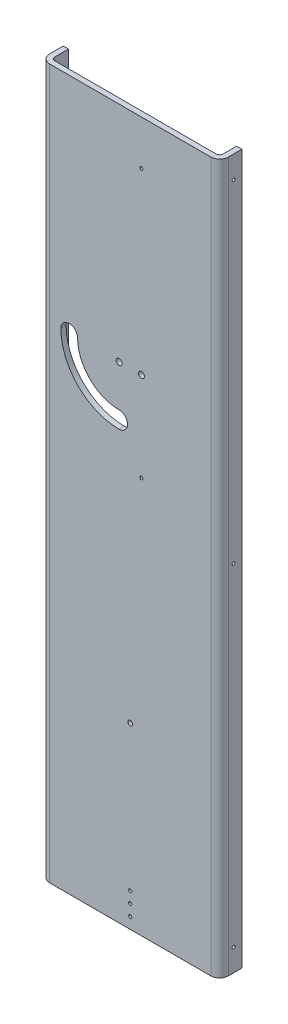
ISO-10303-21;
HEADER;
FILE_DESCRIPTION(('STEP AP214'),'2;1');
FILE_NAME('part.step','',(''),(''),'','','');
FILE_SCHEMA(('AUTOMOTIVE_DESIGN { 1 0 10303 214 1 1 1 1 }'));
ENDSEC;
DATA;
#1=APPLICATION_CONTEXT('core data for automotive mechanical design processes');
#2=APPLICATION_PROTOCOL_DEFINITION('international standard','automotive_design',2000,#1);
#3=PRODUCT_CONTEXT('',#1,'mechanical');
#4=PRODUCT('Part','Part','',(#3));
#5=PRODUCT_RELATED_PRODUCT_CATEGORY('part','',(#4));
#6=PRODUCT_DEFINITION_FORMATION('','',#4);
#7=PRODUCT_DEFINITION_CONTEXT('part definition',#1,'design');
#8=PRODUCT_DEFINITION('design','',#6,#7);
#9=PRODUCT_DEFINITION_SHAPE('','',#8);
#10=(LENGTH_UNIT() NAMED_UNIT(*) SI_UNIT(.MILLI.,.METRE.));
#11=(NAMED_UNIT(*) PLANE_ANGLE_UNIT() SI_UNIT($,.RADIAN.));
#12=(NAMED_UNIT(*) SI_UNIT($,.STERADIAN.) SOLID_ANGLE_UNIT());
#13=UNCERTAINTY_MEASURE_WITH_UNIT(LENGTH_MEASURE(1.E-05),#10,'distance_accuracy_value','');
#14=(GEOMETRIC_REPRESENTATION_CONTEXT(3) GLOBAL_UNCERTAINTY_ASSIGNED_CONTEXT((#13)) GLOBAL_UNIT_ASSIGNED_CONTEXT((#10,
#11,#12)) REPRESENTATION_CONTEXT('',''));
#15=CARTESIAN_POINT('',(0.,0.,0.));
#16=DIRECTION('',(0.,0.,1.));
#17=DIRECTION('',(1.,0.,0.));
#18=AXIS2_PLACEMENT_3D('',#15,#16,#17);
#19=CARTESIAN_POINT('',(101.6,584.2,-9.875));
#20=DIRECTION('',(-1.,0.,0.));
#21=DIRECTION('',(0.,0.,1.));
#22=AXIS2_PLACEMENT_3D('',#19,#20,#21);
#23=CYLINDRICAL_SURFACE('',#22,1.62941);
#24=CARTESIAN_POINT('',(101.6,584.2,-9.875));
#25=DIRECTION('',(-1.,0.,0.));
#26=DIRECTION('',(0.,0.,1.));
#27=AXIS2_PLACEMENT_3D('',#24,#25,#26);
#28=CIRCLE('',#27,1.62941);
#29=CARTESIAN_POINT('',(101.6,584.2,-8.24559));
#30=VERTEX_POINT('',#29);
#31=EDGE_CURVE('E21',#30,#30,#28,.F.);
#32=ORIENTED_EDGE('',*,*,#31,.T.);
#33=EDGE_LOOP('',(#32));
#34=FACE_BOUND('',#33,.T.);
#35=CARTESIAN_POINT('',(95.6,584.2,-9.875));
#36=DIRECTION('',(-1.,0.,0.));
#37=DIRECTION('',(0.,0.,1.));
#38=AXIS2_PLACEMENT_3D('',#35,#36,#37);
#39=CIRCLE('',#38,1.62941);
#40=CARTESIAN_POINT('',(95.6,584.2,-8.24559));
#41=VERTEX_POINT('',#40);
#42=EDGE_CURVE('E295',#41,#41,#39,.F.);
#43=ORIENTED_EDGE('',*,*,#42,.F.);
#44=EDGE_LOOP('',(#43));
#45=FACE_BOUND('',#44,.T.);
#46=ADVANCED_FACE('F17',(#34,#45),#23,.F.);
#47=CARTESIAN_POINT('',(101.6,206.375,-9.875));
#48=DIRECTION('',(-1.,0.,0.));
#49=DIRECTION('',(0.,0.,1.));
#50=AXIS2_PLACEMENT_3D('',#47,#48,#49);
#51=CYLINDRICAL_SURFACE('',#50,1.62941);
#52=CARTESIAN_POINT('',(101.6,206.375,-9.875));
#53=DIRECTION('',(-1.,0.,0.));
#54=DIRECTION('',(0.,0.,1.));
#55=AXIS2_PLACEMENT_3D('',#52,#53,#54);
#56=CIRCLE('',#55,1.62941);
#57=CARTESIAN_POINT('',(101.6,206.375,-8.24559));
#58=VERTEX_POINT('',#57);
#59=EDGE_CURVE('E299',#58,#58,#56,.F.);
#60=ORIENTED_EDGE('',*,*,#59,.T.);
#61=EDGE_LOOP('',(#60));
#62=FACE_BOUND('',#61,.T.);
#63=CARTESIAN_POINT('',(95.6,206.375,-9.875));
#64=DIRECTION('',(-1.,0.,0.));
#65=DIRECTION('',(0.,0.,1.));
#66=AXIS2_PLACEMENT_3D('',#63,#64,#65);
#67=CIRCLE('',#66,1.62941);
#68=CARTESIAN_POINT('',(95.6,206.375,-8.24559));
#69=VERTEX_POINT('',#68);
#70=EDGE_CURVE('E292',#69,#69,#67,.F.);
#71=ORIENTED_EDGE('',*,*,#70,.F.);
#72=EDGE_LOOP('',(#71));
#73=FACE_BOUND('',#72,.T.);
#74=ADVANCED_FACE('F403',(#62,#73),#51,.F.);
#75=CARTESIAN_POINT('',(101.6,-171.45,-9.875));
#76=DIRECTION('',(-1.,0.,0.));
#77=DIRECTION('',(0.,0.,1.));
#78=AXIS2_PLACEMENT_3D('',#75,#76,#77);
#79=CYLINDRICAL_SURFACE('',#78,1.62941);
#80=CARTESIAN_POINT('',(101.6,-171.45,-9.875));
#81=DIRECTION('',(-1.,0.,0.));
#82=DIRECTION('',(0.,0.,1.));
#83=AXIS2_PLACEMENT_3D('',#80,#81,#82);
#84=CIRCLE('',#83,1.62941);
#85=CARTESIAN_POINT('',(101.6,-171.45,-8.24559));
#86=VERTEX_POINT('',#85);
#87=EDGE_CURVE('E150',#86,#86,#84,.F.);
#88=ORIENTED_EDGE('',*,*,#87,.T.);
#89=EDGE_LOOP('',(#88));
#90=FACE_BOUND('',#89,.T.);
#91=CARTESIAN_POINT('',(95.6,-171.45,-9.875));
#92=DIRECTION('',(-1.,0.,0.));
#93=DIRECTION('',(0.,0.,1.));
#94=AXIS2_PLACEMENT_3D('',#91,#92,#93);
#95=CIRCLE('',#94,1.62941);
#96=CARTESIAN_POINT('',(95.6,-171.45,-8.24559));
#97=VERTEX_POINT('',#96);
#98=EDGE_CURVE('E289',#97,#97,#95,.F.);
#99=ORIENTED_EDGE('',*,*,#98,.F.);
#100=EDGE_LOOP('',(#99));
#101=FACE_BOUND('',#100,.T.);
#102=ADVANCED_FACE('F399',(#90,#101),#79,.F.);
#103=CARTESIAN_POINT('',(-95.6,584.2,-9.875));
#104=DIRECTION('',(-1.,0.,0.));
#105=DIRECTION('',(0.,0.,1.));
#106=AXIS2_PLACEMENT_3D('',#103,#104,#105);
#107=CYLINDRICAL_SURFACE('',#106,1.62941);
#108=CARTESIAN_POINT('',(-95.6,584.2,-9.875));
#109=DIRECTION('',(-1.,0.,0.));
#110=DIRECTION('',(0.,0.,1.));
#111=AXIS2_PLACEMENT_3D('',#108,#109,#110);
#112=CIRCLE('',#111,1.62941);
#113=CARTESIAN_POINT('',(-95.6,584.2,-8.24559));
#114=VERTEX_POINT('',#113);
#115=EDGE_CURVE('E286',#114,#114,#112,.T.);
#116=ORIENTED_EDGE('',*,*,#115,.F.);
#117=EDGE_LOOP('',(#116));
#118=FACE_BOUND('',#117,.T.);
#119=CARTESIAN_POINT('',(-101.6,584.2,-9.875));
#120=DIRECTION('',(-1.,0.,0.));
#121=DIRECTION('',(0.,0.,1.));
#122=AXIS2_PLACEMENT_3D('',#119,#120,#121);
#123=CIRCLE('',#122,1.62941);
#124=CARTESIAN_POINT('',(-101.6,584.2,-8.24559));
#125=VERTEX_POINT('',#124);
#126=EDGE_CURVE('E275',#125,#125,#123,.T.);
#127=ORIENTED_EDGE('',*,*,#126,.T.);
#128=EDGE_LOOP('',(#127));
#129=FACE_BOUND('',#128,.T.);
#130=ADVANCED_FACE('F395',(#118,#129),#107,.F.);
#131=CARTESIAN_POINT('',(-95.6,206.375,-9.875));
#132=DIRECTION('',(-1.,0.,0.));
#133=DIRECTION('',(0.,0.,1.));
#134=AXIS2_PLACEMENT_3D('',#131,#132,#133);
#135=CYLINDRICAL_SURFACE('',#134,1.62941);
#136=CARTESIAN_POINT('',(-95.6,206.375,-9.875));
#137=DIRECTION('',(-1.,0.,0.));
#138=DIRECTION('',(0.,0.,1.));
#139=AXIS2_PLACEMENT_3D('',#136,#137,#138);
#140=CIRCLE('',#139,1.62941);
#141=CARTESIAN_POINT('',(-95.6,206.375,-8.24559));
#142=VERTEX_POINT('',#141);
#143=EDGE_CURVE('E283',#142,#142,#140,.T.);
#144=ORIENTED_EDGE('',*,*,#143,.F.);
#145=EDGE_LOOP('',(#144));
#146=FACE_BOUND('',#145,.T.);
#147=CARTESIAN_POINT('',(-101.6,206.375,-9.875));
#148=DIRECTION('',(-1.,0.,0.));
#149=DIRECTION('',(0.,0.,1.));
#150=AXIS2_PLACEMENT_3D('',#147,#148,#149);
#151=CIRCLE('',#150,1.62941);
#152=CARTESIAN_POINT('',(-101.6,206.375,-8.24559));
#153=VERTEX_POINT('',#152);
#154=EDGE_CURVE('E272',#153,#153,#151,.T.);
#155=ORIENTED_EDGE('',*,*,#154,.T.);
#156=EDGE_LOOP('',(#155));
#157=FACE_BOUND('',#156,.T.);
#158=ADVANCED_FACE('F319',(#146,#157),#135,.F.);
#159=CARTESIAN_POINT('',(-95.6,-171.45,-9.875));
#160=DIRECTION('',(-1.,0.,0.));
#161=DIRECTION('',(0.,0.,1.));
#162=AXIS2_PLACEMENT_3D('',#159,#160,#161);
#163=CYLINDRICAL_SURFACE('',#162,1.62941);
#164=CARTESIAN_POINT('',(-95.6,-171.45,-9.875));
#165=DIRECTION('',(-1.,0.,0.));
#166=DIRECTION('',(0.,0.,1.));
#167=AXIS2_PLACEMENT_3D('',#164,#165,#166);
#168=CIRCLE('',#167,1.62941);
#169=CARTESIAN_POINT('',(-95.6,-171.45,-8.24559));
#170=VERTEX_POINT('',#169);
#171=EDGE_CURVE('E279',#170,#170,#168,.T.);
#172=ORIENTED_EDGE('',*,*,#171,.F.);
#173=EDGE_LOOP('',(#172));
#174=FACE_BOUND('',#173,.T.);
#175=CARTESIAN_POINT('',(-101.6,-171.45,-9.875));
#176=DIRECTION('',(-1.,0.,0.));
#177=DIRECTION('',(0.,0.,1.));
#178=AXIS2_PLACEMENT_3D('',#175,#176,#177);
#179=CIRCLE('',#178,1.62941);
#180=CARTESIAN_POINT('',(-101.6,-171.45,-8.24559));
#181=VERTEX_POINT('',#180);
#182=EDGE_CURVE('E269',#181,#181,#179,.T.);
#183=ORIENTED_EDGE('',*,*,#182,.T.);
#184=EDGE_LOOP('',(#183));
#185=FACE_BOUND('',#184,.T.);
#186=ADVANCED_FACE('F309',(#174,#185),#163,.F.);
#187=CARTESIAN_POINT('',(101.6,-196.85,-19.4));
#188=DIRECTION('',(-1.,0.,0.));
#189=DIRECTION('',(0.,0.,1.));
#190=AXIS2_PLACEMENT_3D('',#187,#188,#189);
#191=PLANE('',#190);
#192=ORIENTED_EDGE('',*,*,#87,.F.);
#193=EDGE_LOOP('',(#192));
#194=FACE_BOUND('',#193,.T.);
#195=ORIENTED_EDGE('',*,*,#59,.F.);
#196=EDGE_LOOP('',(#195));
#197=FACE_BOUND('',#196,.T.);
#198=ORIENTED_EDGE('',*,*,#31,.F.);
#199=EDGE_LOOP('',(#198));
#200=FACE_BOUND('',#199,.T.);
#201=DIRECTION('',(0.,0.,-1.));
#202=VECTOR('',#201,1.);
#203=CARTESIAN_POINT('',(101.6,609.6,-6.7));
#204=LINE('',#203,#202);
#205=CARTESIAN_POINT('',(101.6,609.6,-4.00000012697449));
#206=VERTEX_POINT('',#205);
#207=CARTESIAN_POINT('',(101.6,609.6,-19.4));
#208=VERTEX_POINT('',#207);
#209=EDGE_CURVE('E132',#206,#208,#204,.T.);
#210=ORIENTED_EDGE('',*,*,#209,.F.);
#211=DIRECTION('',(0.,1.,0.));
#212=VECTOR('',#211,1.);
#213=CARTESIAN_POINT('',(101.6,206.375,-4.00000012594898));
#214=LINE('',#213,#212);
#215=CARTESIAN_POINT('',(101.6,-196.85,-4.00000012697449));
#216=VERTEX_POINT('',#215);
#217=EDGE_CURVE('E165',#206,#216,#214,.F.);
#218=ORIENTED_EDGE('',*,*,#217,.T.);
#219=DIRECTION('',(0.,0.,-1.));
#220=VECTOR('',#219,1.);
#221=CARTESIAN_POINT('',(101.6,-196.85,-6.7));
#222=LINE('',#221,#220);
#223=CARTESIAN_POINT('',(101.6,-196.85,-19.4));
#224=VERTEX_POINT('',#223);
#225=EDGE_CURVE('E146',#216,#224,#222,.T.);
#226=ORIENTED_EDGE('',*,*,#225,.T.);
#227=DIRECTION('',(0.,1.,0.));
#228=VECTOR('',#227,1.);
#229=CARTESIAN_POINT('',(101.6,206.375,-19.4));
#230=LINE('',#229,#228);
#231=EDGE_CURVE('E144',#224,#208,#230,.T.);
#232=ORIENTED_EDGE('',*,*,#231,.T.);
#233=EDGE_LOOP('',(#210,#218,#226,#232));
#234=FACE_BOUND('',#233,.T.);
#235=ADVANCED_FACE('F145',(#194,#197,#200,#234),#191,.F.);
#236=CARTESIAN_POINT('',(95.6,-196.85,-19.4));
#237=DIRECTION('',(0.,0.,1.));
#238=DIRECTION('',(1.,0.,0.));
#239=AXIS2_PLACEMENT_3D('',#236,#237,#238);
#240=PLANE('',#239);
#241=DIRECTION('',(-1.,0.,0.));
#242=VECTOR('',#241,1.);
#243=CARTESIAN_POINT('',(0.,-196.85,-19.4));
#244=LINE('',#243,#242);
#245=CARTESIAN_POINT('',(95.6000000056,-196.85,-19.4));
#246=VERTEX_POINT('',#245);
#247=EDGE_CURVE('E176',#224,#246,#244,.T.);
#248=ORIENTED_EDGE('',*,*,#247,.T.);
#249=DIRECTION('',(0.,-1.,0.));
#250=VECTOR('',#249,1.);
#251=CARTESIAN_POINT('',(95.6,206.375,-19.4));
#252=LINE('',#251,#250);
#253=CARTESIAN_POINT('',(95.6000000074666,609.6,-19.4));
#254=VERTEX_POINT('',#253);
#255=EDGE_CURVE('E120',#254,#246,#252,.T.);
#256=ORIENTED_EDGE('',*,*,#255,.F.);
#257=DIRECTION('',(-1.,0.,0.));
#258=VECTOR('',#257,1.);
#259=CARTESIAN_POINT('',(0.,609.6,-19.4));
#260=LINE('',#259,#258);
#261=EDGE_CURVE('E136',#208,#254,#260,.T.);
#262=ORIENTED_EDGE('',*,*,#261,.F.);
#263=ORIENTED_EDGE('',*,*,#231,.F.);
#264=EDGE_LOOP('',(#248,#256,#262,#263));
#265=FACE_BOUND('',#264,.T.);
#266=ADVANCED_FACE('F152',(#265),#240,.F.);
#267=CARTESIAN_POINT('',(95.6,-196.85,-19.4));
#268=DIRECTION('',(-1.,0.,0.));
#269=DIRECTION('',(0.,0.,1.));
#270=AXIS2_PLACEMENT_3D('',#267,#268,#269);
#271=PLANE('',#270);
#272=ORIENTED_EDGE('',*,*,#98,.T.);
#273=EDGE_LOOP('',(#272));
#274=FACE_BOUND('',#273,.T.);
#275=ORIENTED_EDGE('',*,*,#70,.T.);
#276=EDGE_LOOP('',(#275));
#277=FACE_BOUND('',#276,.T.);
#278=ORIENTED_EDGE('',*,*,#42,.T.);
#279=EDGE_LOOP('',(#278));
#280=FACE_BOUND('',#279,.T.);
#281=DIRECTION('',(0.,1.,0.));
#282=VECTOR('',#281,1.);
#283=CARTESIAN_POINT('',(95.6,206.375,-4.00000012717959));
#284=LINE('',#283,#282);
#285=CARTESIAN_POINT('',(95.6000000056,609.6,-4.00000012758979));
#286=VERTEX_POINT('',#285);
#287=CARTESIAN_POINT('',(95.6000000056,-196.85,-4.00000012758979));
#288=VERTEX_POINT('',#287);
#289=EDGE_CURVE('E111',#286,#288,#284,.F.);
#290=ORIENTED_EDGE('',*,*,#289,.F.);
#291=DIRECTION('',(0.,0.,1.));
#292=VECTOR('',#291,1.);
#293=CARTESIAN_POINT('',(95.6000000112,609.6,-6.7));
#294=LINE('',#293,#292);
#295=EDGE_CURVE('E153',#254,#286,#294,.T.);
#296=ORIENTED_EDGE('',*,*,#295,.F.);
#297=ORIENTED_EDGE('',*,*,#255,.T.);
#298=DIRECTION('',(0.,0.,1.));
#299=VECTOR('',#298,1.);
#300=CARTESIAN_POINT('',(95.6000000112,-196.85,-6.7));
#301=LINE('',#300,#299);
#302=EDGE_CURVE('E178',#246,#288,#301,.T.);
#303=ORIENTED_EDGE('',*,*,#302,.T.);
#304=EDGE_LOOP('',(#290,#296,#297,#303));
#305=FACE_BOUND('',#304,.T.);
#306=ADVANCED_FACE('F317',(#274,#277,#280,#305),#271,.T.);
#307=CARTESIAN_POINT('',(-95.6,-196.85,-4.000000128));
#308=DIRECTION('',(1.,0.,0.));
#309=DIRECTION('',(0.,0.,-1.));
#310=AXIS2_PLACEMENT_3D('',#307,#308,#309);
#311=PLANE('',#310);
#312=ORIENTED_EDGE('',*,*,#171,.T.);
#313=EDGE_LOOP('',(#312));
#314=FACE_BOUND('',#313,.T.);
#315=ORIENTED_EDGE('',*,*,#143,.T.);
#316=EDGE_LOOP('',(#315));
#317=FACE_BOUND('',#316,.T.);
#318=ORIENTED_EDGE('',*,*,#115,.T.);
#319=EDGE_LOOP('',(#318));
#320=FACE_BOUND('',#319,.T.);
#321=DIRECTION('',(0.,-1.,0.));
#322=VECTOR('',#321,1.);
#323=CARTESIAN_POINT('',(-95.6,206.375,-4.00000012953876));
#324=LINE('',#323,#322);
#325=CARTESIAN_POINT('',(-95.6000000056,-196.85,-4.00000012876938));
#326=VERTEX_POINT('',#325);
#327=CARTESIAN_POINT('',(-95.6000000056,609.6,-4.00000012876938));
#328=VERTEX_POINT('',#327);
#329=EDGE_CURVE('E675',#326,#328,#324,.F.);
#330=ORIENTED_EDGE('',*,*,#329,.F.);
#331=DIRECTION('',(0.,0.,-1.));
#332=VECTOR('',#331,1.);
#333=CARTESIAN_POINT('',(-95.6000000112,-196.85,-6.7));
#334=LINE('',#333,#332);
#335=CARTESIAN_POINT('',(-95.6000000074667,-196.85,-19.4));
#336=VERTEX_POINT('',#335);
#337=EDGE_CURVE('E173',#326,#336,#334,.T.);
#338=ORIENTED_EDGE('',*,*,#337,.T.);
#339=DIRECTION('',(0.,1.,0.));
#340=VECTOR('',#339,1.);
#341=CARTESIAN_POINT('',(-95.6,206.375,-19.4));
#342=LINE('',#341,#340);
#343=CARTESIAN_POINT('',(-95.6000000074667,609.6,-19.4));
#344=VERTEX_POINT('',#343);
#345=EDGE_CURVE('E282',#336,#344,#342,.T.);
#346=ORIENTED_EDGE('',*,*,#345,.T.);
#347=DIRECTION('',(0.,0.,-1.));
#348=VECTOR('',#347,1.);
#349=CARTESIAN_POINT('',(-95.6000000112,609.6,-6.7));
#350=LINE('',#349,#348);
#351=EDGE_CURVE('E257',#328,#344,#350,.T.);
#352=ORIENTED_EDGE('',*,*,#351,.F.);
#353=EDGE_LOOP('',(#330,#338,#346,#352));
#354=FACE_BOUND('',#353,.T.);
#355=ADVANCED_FACE('F453',(#314,#317,#320,#354),#311,.T.);
#356=CARTESIAN_POINT('',(-101.6,-196.85,-19.4));
#357=DIRECTION('',(0.,0.,1.));
#358=DIRECTION('',(1.,0.,0.));
#359=AXIS2_PLACEMENT_3D('',#356,#357,#358);
#360=PLANE('',#359);
#361=DIRECTION('',(-1.,0.,0.));
#362=VECTOR('',#361,1.);
#363=CARTESIAN_POINT('',(0.,609.6,-19.4));
#364=LINE('',#363,#362);
#365=CARTESIAN_POINT('',(-101.6,609.6,-19.4));
#366=VERTEX_POINT('',#365);
#367=EDGE_CURVE('E680',#344,#366,#364,.T.);
#368=ORIENTED_EDGE('',*,*,#367,.F.);
#369=ORIENTED_EDGE('',*,*,#345,.F.);
#370=DIRECTION('',(-1.,0.,0.));
#371=VECTOR('',#370,1.);
#372=CARTESIAN_POINT('',(0.,-196.85,-19.4));
#373=LINE('',#372,#371);
#374=CARTESIAN_POINT('',(-101.6,-196.85,-19.4));
#375=VERTEX_POINT('',#374);
#376=EDGE_CURVE('E169',#336,#375,#373,.T.);
#377=ORIENTED_EDGE('',*,*,#376,.T.);
#378=DIRECTION('',(0.,1.,0.));
#379=VECTOR('',#378,1.);
#380=CARTESIAN_POINT('',(-101.6,206.375,-19.4));
#381=LINE('',#380,#379);
#382=EDGE_CURVE('E278',#375,#366,#381,.T.);
#383=ORIENTED_EDGE('',*,*,#382,.T.);
#384=EDGE_LOOP('',(#368,#369,#377,#383));
#385=FACE_BOUND('',#384,.T.);
#386=ADVANCED_FACE('F463',(#385),#360,.F.);
#387=CARTESIAN_POINT('',(-101.6,-196.85,-4.000000128));
#388=DIRECTION('',(1.,0.,0.));
#389=DIRECTION('',(0.,0.,-1.));
#390=AXIS2_PLACEMENT_3D('',#387,#388,#389);
#391=PLANE('',#390);
#392=ORIENTED_EDGE('',*,*,#182,.F.);
#393=EDGE_LOOP('',(#392));
#394=FACE_BOUND('',#393,.T.);
#395=ORIENTED_EDGE('',*,*,#154,.F.);
#396=EDGE_LOOP('',(#395));
#397=FACE_BOUND('',#396,.T.);
#398=ORIENTED_EDGE('',*,*,#126,.F.);
#399=EDGE_LOOP('',(#398));
#400=FACE_BOUND('',#399,.T.);
#401=DIRECTION('',(0.,0.,1.));
#402=VECTOR('',#401,1.);
#403=CARTESIAN_POINT('',(-101.6,-196.85,-6.7));
#404=LINE('',#403,#402);
#405=CARTESIAN_POINT('',(-101.6,-196.85,-4.00000012992345));
#406=VERTEX_POINT('',#405);
#407=EDGE_CURVE('E172',#375,#406,#404,.T.);
#408=ORIENTED_EDGE('',*,*,#407,.T.);
#409=DIRECTION('',(0.,-1.,0.));
#410=VECTOR('',#409,1.);
#411=CARTESIAN_POINT('',(-101.6,206.375,-4.0000001318469));
#412=LINE('',#411,#410);
#413=CARTESIAN_POINT('',(-101.6,609.6,-4.00000012992345));
#414=VERTEX_POINT('',#413);
#415=EDGE_CURVE('E659',#406,#414,#412,.F.);
#416=ORIENTED_EDGE('',*,*,#415,.T.);
#417=DIRECTION('',(0.,0.,1.));
#418=VECTOR('',#417,1.);
#419=CARTESIAN_POINT('',(-101.6,609.6,-6.7));
#420=LINE('',#419,#418);
#421=EDGE_CURVE('E253',#366,#414,#420,.T.);
#422=ORIENTED_EDGE('',*,*,#421,.F.);
#423=ORIENTED_EDGE('',*,*,#382,.F.);
#424=EDGE_LOOP('',(#408,#416,#422,#423));
#425=FACE_BOUND('',#424,.T.);
#426=ADVANCED_FACE('F391',(#394,#397,#400,#425),#391,.F.);
#427=CARTESIAN_POINT('',(91.599999872,609.6,-4.000000128));
#428=DIRECTION('',(0.,-1.,0.));
#429=DIRECTION('',(1.,0.,0.));
#430=AXIS2_PLACEMENT_3D('',#427,#428,#429);
#431=CYLINDRICAL_SURFACE('',#430,4.000000128);
#432=DIRECTION('',(0.,1.,0.));
#433=VECTOR('',#432,1.);
#434=CARTESIAN_POINT('',(91.599999872,206.375,0.));
#435=LINE('',#434,#433);
#436=CARTESIAN_POINT('',(91.5999998719944,-196.85,0.));
#437=VERTEX_POINT('',#436);
#438=CARTESIAN_POINT('',(91.599999872,609.6,0.));
#439=VERTEX_POINT('',#438);
#440=EDGE_CURVE('E662',#437,#439,#435,.T.);
#441=ORIENTED_EDGE('',*,*,#440,.T.);
#442=CARTESIAN_POINT('',(91.599999872,609.6,-4.000000128));
#443=DIRECTION('',(0.,-1.,0.));
#444=DIRECTION('',(1.,0.,0.));
#445=AXIS2_PLACEMENT_3D('',#442,#443,#444);
#446=CIRCLE('',#445,4.000000128);
#447=EDGE_CURVE('E155',#286,#439,#446,.T.);
#448=ORIENTED_EDGE('',*,*,#447,.F.);
#449=ORIENTED_EDGE('',*,*,#289,.T.);
#450=CARTESIAN_POINT('',(91.5999998719888,-196.85,-4.000000128));
#451=DIRECTION('',(0.,-1.,0.));
#452=DIRECTION('',(1.,0.,0.));
#453=AXIS2_PLACEMENT_3D('',#450,#451,#452);
#454=CIRCLE('',#453,4.000000128);
#455=EDGE_CURVE('E267',#288,#437,#454,.T.);
#456=ORIENTED_EDGE('',*,*,#455,.T.);
#457=EDGE_LOOP('',(#441,#448,#449,#456));
#458=FACE_BOUND('',#457,.T.);
#459=ADVANCED_FACE('F388',(#458),#431,.F.);
#460=CARTESIAN_POINT('',(-91.599999872,-196.85,-4.000000128));
#461=DIRECTION('',(0.,1.,0.));
#462=DIRECTION('',(0.,0.,1.));
#463=AXIS2_PLACEMENT_3D('',#460,#461,#462);
#464=CYLINDRICAL_SURFACE('',#463,4.000000128);
#465=DIRECTION('',(0.,-1.,0.));
#466=VECTOR('',#465,1.);
#467=CARTESIAN_POINT('',(-91.599999872,206.375,0.));
#468=LINE('',#467,#466);
#469=CARTESIAN_POINT('',(-91.599999872,609.6,0.));
#470=VERTEX_POINT('',#469);
#471=CARTESIAN_POINT('',(-91.599999872,-196.85,0.));
#472=VERTEX_POINT('',#471);
#473=EDGE_CURVE('E249',#470,#472,#468,.T.);
#474=ORIENTED_EDGE('',*,*,#473,.T.);
#475=CARTESIAN_POINT('',(-91.599999872,-196.85,-4.000000128));
#476=DIRECTION('',(0.,1.,0.));
#477=DIRECTION('',(0.,0.,1.));
#478=AXIS2_PLACEMENT_3D('',#475,#476,#477);
#479=CIRCLE('',#478,4.000000128);
#480=EDGE_CURVE('E264',#472,#326,#479,.F.);
#481=ORIENTED_EDGE('',*,*,#480,.T.);
#482=ORIENTED_EDGE('',*,*,#329,.T.);
#483=CARTESIAN_POINT('',(-91.599999872,609.6,-4.000000128));
#484=DIRECTION('',(0.,1.,0.));
#485=DIRECTION('',(0.,0.,1.));
#486=AXIS2_PLACEMENT_3D('',#483,#484,#485);
#487=CIRCLE('',#486,4.000000128);
#488=EDGE_CURVE('E254',#470,#328,#487,.F.);
#489=ORIENTED_EDGE('',*,*,#488,.F.);
#490=EDGE_LOOP('',(#474,#481,#482,#489));
#491=FACE_BOUND('',#490,.T.);
#492=ADVANCED_FACE('F384',(#491),#464,.F.);
#493=CARTESIAN_POINT('',(-91.599999872,-196.85,-4.000000128));
#494=DIRECTION('',(0.,1.,0.));
#495=DIRECTION('',(0.,0.,1.));
#496=AXIS2_PLACEMENT_3D('',#493,#494,#495);
#497=CYLINDRICAL_SURFACE('',#496,10.000000128);
#498=DIRECTION('',(0.,-1.,0.));
#499=VECTOR('',#498,1.);
#500=CARTESIAN_POINT('',(-91.599999872,206.375,6.));
#501=LINE('',#500,#499);
#502=CARTESIAN_POINT('',(-91.599999872,609.6,6.));
#503=VERTEX_POINT('',#502);
#504=CARTESIAN_POINT('',(-91.599999872,-196.85,6.));
#505=VERTEX_POINT('',#504);
#506=EDGE_CURVE('E644',#503,#505,#501,.T.);
#507=ORIENTED_EDGE('',*,*,#506,.F.);
#508=CARTESIAN_POINT('',(-91.599999872,609.6,-4.000000128));
#509=DIRECTION('',(0.,1.,0.));
#510=DIRECTION('',(0.,0.,1.));
#511=AXIS2_PLACEMENT_3D('',#508,#509,#510);
#512=CIRCLE('',#511,10.000000128);
#513=EDGE_CURVE('E250',#414,#503,#512,.T.);
#514=ORIENTED_EDGE('',*,*,#513,.F.);
#515=ORIENTED_EDGE('',*,*,#415,.F.);
#516=CARTESIAN_POINT('',(-91.599999872,-196.85,-4.000000128));
#517=DIRECTION('',(0.,1.,0.));
#518=DIRECTION('',(0.,0.,1.));
#519=AXIS2_PLACEMENT_3D('',#516,#517,#518);
#520=CIRCLE('',#519,10.000000128);
#521=EDGE_CURVE('E168',#406,#505,#520,.T.);
#522=ORIENTED_EDGE('',*,*,#521,.T.);
#523=EDGE_LOOP('',(#507,#514,#515,#522));
#524=FACE_BOUND('',#523,.T.);
#525=ADVANCED_FACE('F381',(#524),#497,.T.);
#526=CARTESIAN_POINT('',(-101.6,-196.85,-19.4));
#527=DIRECTION('',(0.,1.,0.));
#528=DIRECTION('',(0.,0.,1.));
#529=AXIS2_PLACEMENT_3D('',#526,#527,#528);
#530=PLANE('',#529);
#531=ORIENTED_EDGE('',*,*,#521,.F.);
#532=ORIENTED_EDGE('',*,*,#407,.F.);
#533=ORIENTED_EDGE('',*,*,#376,.F.);
#534=ORIENTED_EDGE('',*,*,#337,.F.);
#535=ORIENTED_EDGE('',*,*,#480,.F.);
#536=DIRECTION('',(1.,0.,0.));
#537=VECTOR('',#536,1.);
#538=CARTESIAN_POINT('',(0.,-196.85,0.));
#539=LINE('',#538,#537);
#540=EDGE_CURVE('E666',#472,#437,#539,.T.);
#541=ORIENTED_EDGE('',*,*,#540,.T.);
#542=ORIENTED_EDGE('',*,*,#455,.F.);
#543=ORIENTED_EDGE('',*,*,#302,.F.);
#544=ORIENTED_EDGE('',*,*,#247,.F.);
#545=ORIENTED_EDGE('',*,*,#225,.F.);
#546=CARTESIAN_POINT('',(91.5999998719955,-196.85,-4.000000128));
#547=DIRECTION('',(0.,-1.,0.));
#548=DIRECTION('',(1.,0.,0.));
#549=AXIS2_PLACEMENT_3D('',#546,#547,#548);
#550=CIRCLE('',#549,10.000000128);
#551=CARTESIAN_POINT('',(91.5999998719978,-196.85,6.));
#552=VERTEX_POINT('',#551);
#553=EDGE_CURVE('E167',#216,#552,#550,.T.);
#554=ORIENTED_EDGE('',*,*,#553,.T.);
#555=DIRECTION('',(1.,0.,0.));
#556=VECTOR('',#555,1.);
#557=CARTESIAN_POINT('',(0.,-196.85,6.));
#558=LINE('',#557,#556);
#559=EDGE_CURVE('E637',#505,#552,#558,.T.);
#560=ORIENTED_EDGE('',*,*,#559,.F.);
#561=EDGE_LOOP('',(#531,#532,#533,#534,#535,#541,#542,#543,#544,#545,#554,#560));
#562=FACE_BOUND('',#561,.T.);
#563=ADVANCED_FACE('F379',(#562),#530,.F.);
#564=CARTESIAN_POINT('',(91.599999872,609.6,-4.000000128));
#565=DIRECTION('',(0.,-1.,0.));
#566=DIRECTION('',(1.,0.,0.));
#567=AXIS2_PLACEMENT_3D('',#564,#565,#566);
#568=CYLINDRICAL_SURFACE('',#567,10.000000128);
#569=DIRECTION('',(0.,1.,0.));
#570=VECTOR('',#569,1.);
#571=CARTESIAN_POINT('',(91.599999872,206.375,6.));
#572=LINE('',#571,#570);
#573=CARTESIAN_POINT('',(91.599999872,609.6,6.));
#574=VERTEX_POINT('',#573);
#575=EDGE_CURVE('E634',#552,#574,#572,.T.);
#576=ORIENTED_EDGE('',*,*,#575,.F.);
#577=ORIENTED_EDGE('',*,*,#553,.F.);
#578=ORIENTED_EDGE('',*,*,#217,.F.);
#579=CARTESIAN_POINT('',(91.599999872,609.6,-4.000000128));
#580=DIRECTION('',(0.,-1.,0.));
#581=DIRECTION('',(1.,0.,0.));
#582=AXIS2_PLACEMENT_3D('',#579,#580,#581);
#583=CIRCLE('',#582,10.000000128);
#584=EDGE_CURVE('E139',#574,#206,#583,.F.);
#585=ORIENTED_EDGE('',*,*,#584,.F.);
#586=EDGE_LOOP('',(#576,#577,#578,#585));
#587=FACE_BOUND('',#586,.T.);
#588=ADVANCED_FACE('F376',(#587),#568,.T.);
#589=CARTESIAN_POINT('',(-101.6,609.6,-19.4));
#590=DIRECTION('',(0.,1.,0.));
#591=DIRECTION('',(0.,0.,1.));
#592=AXIS2_PLACEMENT_3D('',#589,#590,#591);
#593=PLANE('',#592);
#594=ORIENTED_EDGE('',*,*,#421,.T.);
#595=ORIENTED_EDGE('',*,*,#513,.T.);
#596=DIRECTION('',(-1.,0.,0.));
#597=VECTOR('',#596,1.);
#598=CARTESIAN_POINT('',(0.,609.6,6.));
#599=LINE('',#598,#597);
#600=EDGE_CURVE('E218',#574,#503,#599,.T.);
#601=ORIENTED_EDGE('',*,*,#600,.F.);
#602=ORIENTED_EDGE('',*,*,#584,.T.);
#603=ORIENTED_EDGE('',*,*,#209,.T.);
#604=ORIENTED_EDGE('',*,*,#261,.T.);
#605=ORIENTED_EDGE('',*,*,#295,.T.);
#606=ORIENTED_EDGE('',*,*,#447,.T.);
#607=DIRECTION('',(-1.,0.,0.));
#608=VECTOR('',#607,1.);
#609=CARTESIAN_POINT('',(0.,609.6,0.));
#610=LINE('',#609,#608);
#611=EDGE_CURVE('E665',#439,#470,#610,.T.);
#612=ORIENTED_EDGE('',*,*,#611,.T.);
#613=ORIENTED_EDGE('',*,*,#488,.T.);
#614=ORIENTED_EDGE('',*,*,#351,.T.);
#615=ORIENTED_EDGE('',*,*,#367,.T.);
#616=EDGE_LOOP('',(#594,#595,#601,#602,#603,#604,#605,#606,#612,#613,#614,#615));
#617=FACE_BOUND('',#616,.T.);
#618=ADVANCED_FACE('F134',(#617),#593,.T.);
#619=CARTESIAN_POINT('',(-12.7,355.6,0.));
#620=DIRECTION('',(0.,0.,1.));
#621=DIRECTION('',(1.,0.,0.));
#622=AXIS2_PLACEMENT_3D('',#619,#620,#621);
#623=CYLINDRICAL_SURFACE('',#622,66.199999872);
#624=DIRECTION('',(0.,0.,1.));
#625=VECTOR('',#624,1.);
#626=CARTESIAN_POINT('',(-78.899999872,355.599999996093,3.));
#627=LINE('',#626,#625);
#628=CARTESIAN_POINT('',(-78.899999872,355.599999998046,6.));
#629=VERTEX_POINT('',#628);
#630=CARTESIAN_POINT('',(-78.899999872,355.599999998046,0.));
#631=VERTEX_POINT('',#630);
#632=EDGE_CURVE('E252',#629,#631,#627,.F.);
#633=ORIENTED_EDGE('',*,*,#632,.F.);
#634=CARTESIAN_POINT('',(-12.7,355.6,6.));
#635=DIRECTION('',(0.,0.,1.));
#636=DIRECTION('',(1.,0.,0.));
#637=AXIS2_PLACEMENT_3D('',#634,#635,#636);
#638=CIRCLE('',#637,66.199999872);
#639=CARTESIAN_POINT('',(-12.7000000018321,289.400000128,6.));
#640=VERTEX_POINT('',#639);
#641=EDGE_CURVE('E216',#640,#629,#638,.F.);
#642=ORIENTED_EDGE('',*,*,#641,.F.);
#643=DIRECTION('',(0.,0.,-1.));
#644=VECTOR('',#643,1.);
#645=CARTESIAN_POINT('',(-12.7000000036642,289.400000128,3.));
#646=LINE('',#645,#644);
#647=CARTESIAN_POINT('',(-12.7000000018321,289.400000128,0.));
#648=VERTEX_POINT('',#647);
#649=EDGE_CURVE('E222',#648,#640,#646,.F.);
#650=ORIENTED_EDGE('',*,*,#649,.F.);
#651=CARTESIAN_POINT('',(-12.7,355.6,0.));
#652=DIRECTION('',(0.,0.,1.));
#653=DIRECTION('',(1.,0.,0.));
#654=AXIS2_PLACEMENT_3D('',#651,#652,#653);
#655=CIRCLE('',#654,66.199999872);
#656=EDGE_CURVE('E244',#648,#631,#655,.F.);
#657=ORIENTED_EDGE('',*,*,#656,.T.);
#658=EDGE_LOOP('',(#633,#642,#650,#657));
#659=FACE_BOUND('',#658,.T.);
#660=ADVANCED_FACE('F371',(#659),#623,.F.);
#661=CARTESIAN_POINT('',(12.7,254.,0.));
#662=DIRECTION('',(0.,0.,1.));
#663=DIRECTION('',(1.,0.,0.));
#664=AXIS2_PLACEMENT_3D('',#661,#662,#663);
#665=CYLINDRICAL_SURFACE('',#664,1.778);
#666=CARTESIAN_POINT('',(12.7,254.,0.));
#667=DIRECTION('',(0.,0.,1.));
#668=DIRECTION('',(1.,0.,0.));
#669=AXIS2_PLACEMENT_3D('',#666,#667,#668);
#670=CIRCLE('',#669,1.778);
#671=CARTESIAN_POINT('',(14.478,254.,0.));
#672=VERTEX_POINT('',#671);
#673=EDGE_CURVE('E241',#672,#672,#670,.F.);
#674=ORIENTED_EDGE('',*,*,#673,.T.);
#675=EDGE_LOOP('',(#674));
#676=FACE_BOUND('',#675,.T.);
#677=CARTESIAN_POINT('',(12.7,254.,6.));
#678=DIRECTION('',(0.,0.,1.));
#679=DIRECTION('',(1.,0.,0.));
#680=AXIS2_PLACEMENT_3D('',#677,#678,#679);
#681=CIRCLE('',#680,1.778);
#682=CARTESIAN_POINT('',(14.478,254.,6.));
#683=VERTEX_POINT('',#682);
#684=EDGE_CURVE('E211',#683,#683,#681,.F.);
#685=ORIENTED_EDGE('',*,*,#684,.F.);
#686=EDGE_LOOP('',(#685));
#687=FACE_BOUND('',#686,.T.);
#688=ADVANCED_FACE('F367',(#676,#687),#665,.F.);
#689=CARTESIAN_POINT('',(12.7,355.6,0.));
#690=DIRECTION('',(0.,0.,1.));
#691=DIRECTION('',(1.,0.,0.));
#692=AXIS2_PLACEMENT_3D('',#689,#690,#691);
#693=CYLINDRICAL_SURFACE('',#692,3.3528);
#694=CARTESIAN_POINT('',(12.7,355.6,0.));
#695=DIRECTION('',(0.,0.,1.));
#696=DIRECTION('',(1.,0.,0.));
#697=AXIS2_PLACEMENT_3D('',#694,#695,#696);
#698=CIRCLE('',#697,3.3528);
#699=CARTESIAN_POINT('',(16.0528,355.6,0.));
#700=VERTEX_POINT('',#699);
#701=EDGE_CURVE('E238',#700,#700,#698,.F.);
#702=ORIENTED_EDGE('',*,*,#701,.T.);
#703=EDGE_LOOP('',(#702));
#704=FACE_BOUND('',#703,.T.);
#705=CARTESIAN_POINT('',(12.7,355.6,6.));
#706=DIRECTION('',(0.,0.,1.));
#707=DIRECTION('',(1.,0.,0.));
#708=AXIS2_PLACEMENT_3D('',#705,#706,#707);
#709=CIRCLE('',#708,3.3528);
#710=CARTESIAN_POINT('',(16.0528,355.6,6.));
#711=VERTEX_POINT('',#710);
#712=EDGE_CURVE('E208',#711,#711,#709,.F.);
#713=ORIENTED_EDGE('',*,*,#712,.F.);
#714=EDGE_LOOP('',(#713));
#715=FACE_BOUND('',#714,.T.);
#716=ADVANCED_FACE('F363',(#704,#715),#693,.F.);
#717=CARTESIAN_POINT('',(-12.7,355.6,0.));
#718=DIRECTION('',(0.,0.,1.));
#719=DIRECTION('',(1.,0.,0.));
#720=AXIS2_PLACEMENT_3D('',#717,#718,#719);
#721=CYLINDRICAL_SURFACE('',#720,3.3528);
#722=CARTESIAN_POINT('',(-12.7,355.6,0.));
#723=DIRECTION('',(0.,0.,1.));
#724=DIRECTION('',(1.,0.,0.));
#725=AXIS2_PLACEMENT_3D('',#722,#723,#724);
#726=CIRCLE('',#725,3.3528);
#727=CARTESIAN_POINT('',(-9.3472,355.6,0.));
#728=VERTEX_POINT('',#727);
#729=EDGE_CURVE('E235',#728,#728,#726,.F.);
#730=ORIENTED_EDGE('',*,*,#729,.T.);
#731=EDGE_LOOP('',(#730));
#732=FACE_BOUND('',#731,.T.);
#733=CARTESIAN_POINT('',(-12.7,355.6,6.));
#734=DIRECTION('',(0.,0.,1.));
#735=DIRECTION('',(1.,0.,0.));
#736=AXIS2_PLACEMENT_3D('',#733,#734,#735);
#737=CIRCLE('',#736,3.3528);
#738=CARTESIAN_POINT('',(-9.3472,355.6,6.));
#739=VERTEX_POINT('',#738);
#740=EDGE_CURVE('E205',#739,#739,#737,.F.);
#741=ORIENTED_EDGE('',*,*,#740,.F.);
#742=EDGE_LOOP('',(#741));
#743=FACE_BOUND('',#742,.T.);
#744=ADVANCED_FACE('F359',(#732,#743),#721,.F.);
#745=CARTESIAN_POINT('',(12.7,558.8,0.));
#746=DIRECTION('',(0.,0.,1.));
#747=DIRECTION('',(1.,0.,0.));
#748=AXIS2_PLACEMENT_3D('',#745,#746,#747);
#749=CYLINDRICAL_SURFACE('',#748,1.778);
#750=CARTESIAN_POINT('',(12.7,558.8,0.));
#751=DIRECTION('',(0.,0.,1.));
#752=DIRECTION('',(1.,0.,0.));
#753=AXIS2_PLACEMENT_3D('',#750,#751,#752);
#754=CIRCLE('',#753,1.778);
#755=CARTESIAN_POINT('',(14.478,558.8,0.));
#756=VERTEX_POINT('',#755);
#757=EDGE_CURVE('E232',#756,#756,#754,.F.);
#758=ORIENTED_EDGE('',*,*,#757,.T.);
#759=EDGE_LOOP('',(#758));
#760=FACE_BOUND('',#759,.T.);
#761=CARTESIAN_POINT('',(12.7,558.8,6.));
#762=DIRECTION('',(0.,0.,1.));
#763=DIRECTION('',(1.,0.,0.));
#764=AXIS2_PLACEMENT_3D('',#761,#762,#763);
#765=CIRCLE('',#764,1.778);
#766=CARTESIAN_POINT('',(14.478,558.8,6.));
#767=VERTEX_POINT('',#766);
#768=EDGE_CURVE('E202',#767,#767,#765,.F.);
#769=ORIENTED_EDGE('',*,*,#768,.F.);
#770=EDGE_LOOP('',(#769));
#771=FACE_BOUND('',#770,.T.);
#772=ADVANCED_FACE('F355',(#760,#771),#749,.F.);
#773=CARTESIAN_POINT('',(0.,-184.15,0.));
#774=DIRECTION('',(0.,0.,1.));
#775=DIRECTION('',(1.,0.,0.));
#776=AXIS2_PLACEMENT_3D('',#773,#774,#775);
#777=CYLINDRICAL_SURFACE('',#776,1.778);
#778=CARTESIAN_POINT('',(0.,-184.15,0.));
#779=DIRECTION('',(0.,0.,1.));
#780=DIRECTION('',(1.,0.,0.));
#781=AXIS2_PLACEMENT_3D('',#778,#779,#780);
#782=CIRCLE('',#781,1.778);
#783=CARTESIAN_POINT('',(1.778,-184.15,0.));
#784=VERTEX_POINT('',#783);
#785=EDGE_CURVE('E229',#784,#784,#782,.F.);
#786=ORIENTED_EDGE('',*,*,#785,.T.);
#787=EDGE_LOOP('',(#786));
#788=FACE_BOUND('',#787,.T.);
#789=CARTESIAN_POINT('',(0.,-184.15,6.));
#790=DIRECTION('',(0.,0.,1.));
#791=DIRECTION('',(1.,0.,0.));
#792=AXIS2_PLACEMENT_3D('',#789,#790,#791);
#793=CIRCLE('',#792,1.778);
#794=CARTESIAN_POINT('',(1.778,-184.15,6.));
#795=VERTEX_POINT('',#794);
#796=EDGE_CURVE('E199',#795,#795,#793,.F.);
#797=ORIENTED_EDGE('',*,*,#796,.F.);
#798=EDGE_LOOP('',(#797));
#799=FACE_BOUND('',#798,.T.);
#800=ADVANCED_FACE('F351',(#788,#799),#777,.F.);
#801=CARTESIAN_POINT('',(0.,-171.45,0.));
#802=DIRECTION('',(0.,0.,1.));
#803=DIRECTION('',(1.,0.,0.));
#804=AXIS2_PLACEMENT_3D('',#801,#802,#803);
#805=CYLINDRICAL_SURFACE('',#804,1.778);
#806=CARTESIAN_POINT('',(0.,-171.45,0.));
#807=DIRECTION('',(0.,0.,1.));
#808=DIRECTION('',(1.,0.,0.));
#809=AXIS2_PLACEMENT_3D('',#806,#807,#808);
#810=CIRCLE('',#809,1.778);
#811=CARTESIAN_POINT('',(1.778,-171.45,0.));
#812=VERTEX_POINT('',#811);
#813=EDGE_CURVE('E226',#812,#812,#810,.F.);
#814=ORIENTED_EDGE('',*,*,#813,.T.);
#815=EDGE_LOOP('',(#814));
#816=FACE_BOUND('',#815,.T.);
#817=CARTESIAN_POINT('',(0.,-171.45,6.));
#818=DIRECTION('',(0.,0.,1.));
#819=DIRECTION('',(1.,0.,0.));
#820=AXIS2_PLACEMENT_3D('',#817,#818,#819);
#821=CIRCLE('',#820,1.778);
#822=CARTESIAN_POINT('',(1.778,-171.45,6.));
#823=VERTEX_POINT('',#822);
#824=EDGE_CURVE('E196',#823,#823,#821,.F.);
#825=ORIENTED_EDGE('',*,*,#824,.F.);
#826=EDGE_LOOP('',(#825));
#827=FACE_BOUND('',#826,.T.);
#828=ADVANCED_FACE('F347',(#816,#827),#805,.F.);
#829=CARTESIAN_POINT('',(0.,-158.75,0.));
#830=DIRECTION('',(0.,0.,1.));
#831=DIRECTION('',(1.,0.,0.));
#832=AXIS2_PLACEMENT_3D('',#829,#830,#831);
#833=CYLINDRICAL_SURFACE('',#832,1.778);
#834=CARTESIAN_POINT('',(0.,-158.75,0.));
#835=DIRECTION('',(0.,0.,1.));
#836=DIRECTION('',(1.,0.,0.));
#837=AXIS2_PLACEMENT_3D('',#834,#835,#836);
#838=CIRCLE('',#837,1.778);
#839=CARTESIAN_POINT('',(1.778,-158.75,0.));
#840=VERTEX_POINT('',#839);
#841=EDGE_CURVE('E223',#840,#840,#838,.F.);
#842=ORIENTED_EDGE('',*,*,#841,.T.);
#843=EDGE_LOOP('',(#842));
#844=FACE_BOUND('',#843,.T.);
#845=CARTESIAN_POINT('',(0.,-158.75,6.));
#846=DIRECTION('',(0.,0.,1.));
#847=DIRECTION('',(1.,0.,0.));
#848=AXIS2_PLACEMENT_3D('',#845,#846,#847);
#849=CIRCLE('',#848,1.778);
#850=CARTESIAN_POINT('',(1.778,-158.75,6.));
#851=VERTEX_POINT('',#850);
#852=EDGE_CURVE('E193',#851,#851,#849,.F.);
#853=ORIENTED_EDGE('',*,*,#852,.F.);
#854=EDGE_LOOP('',(#853));
#855=FACE_BOUND('',#854,.T.);
#856=ADVANCED_FACE('F343',(#844,#855),#833,.F.);
#857=CARTESIAN_POINT('',(0.,6.35,0.));
#858=DIRECTION('',(0.,0.,1.));
#859=DIRECTION('',(1.,0.,0.));
#860=AXIS2_PLACEMENT_3D('',#857,#858,#859);
#861=CYLINDRICAL_SURFACE('',#860,2.667);
#862=CARTESIAN_POINT('',(0.,6.35,0.));
#863=DIRECTION('',(0.,0.,1.));
#864=DIRECTION('',(1.,0.,0.));
#865=AXIS2_PLACEMENT_3D('',#862,#863,#864);
#866=CIRCLE('',#865,2.667);
#867=CARTESIAN_POINT('',(2.667,6.35,0.));
#868=VERTEX_POINT('',#867);
#869=EDGE_CURVE('E219',#868,#868,#866,.F.);
#870=ORIENTED_EDGE('',*,*,#869,.T.);
#871=EDGE_LOOP('',(#870));
#872=FACE_BOUND('',#871,.T.);
#873=CARTESIAN_POINT('',(0.,6.35,6.));
#874=DIRECTION('',(0.,0.,1.));
#875=DIRECTION('',(1.,0.,0.));
#876=AXIS2_PLACEMENT_3D('',#873,#874,#875);
#877=CIRCLE('',#876,2.667);
#878=CARTESIAN_POINT('',(2.667,6.35,6.));
#879=VERTEX_POINT('',#878);
#880=EDGE_CURVE('E190',#879,#879,#877,.F.);
#881=ORIENTED_EDGE('',*,*,#880,.F.);
#882=EDGE_LOOP('',(#881));
#883=FACE_BOUND('',#882,.T.);
#884=ADVANCED_FACE('F339',(#872,#883),#861,.F.);
#885=CARTESIAN_POINT('',(-69.374999872,355.6,0.));
#886=DIRECTION('',(0.,0.,1.));
#887=DIRECTION('',(1.,0.,0.));
#888=AXIS2_PLACEMENT_3D('',#885,#886,#887);
#889=CYLINDRICAL_SURFACE('',#888,9.52499999999999);
#890=DIRECTION('',(0.,0.,-1.));
#891=VECTOR('',#890,1.);
#892=CARTESIAN_POINT('',(-59.849999872,355.599999980659,3.));
#893=LINE('',#892,#891);
#894=CARTESIAN_POINT('',(-59.849999872,355.599999990329,0.));
#895=VERTEX_POINT('',#894);
#896=CARTESIAN_POINT('',(-59.849999872,355.599999990329,6.));
#897=VERTEX_POINT('',#896);
#898=EDGE_CURVE('E184',#895,#897,#893,.F.);
#899=ORIENTED_EDGE('',*,*,#898,.T.);
#900=CARTESIAN_POINT('',(-69.374999872,355.6,6.));
#901=DIRECTION('',(0.,0.,1.));
#902=DIRECTION('',(1.,0.,0.));
#903=AXIS2_PLACEMENT_3D('',#900,#901,#902);
#904=CIRCLE('',#903,9.52499999999999);
#905=EDGE_CURVE('E214',#629,#897,#904,.F.);
#906=ORIENTED_EDGE('',*,*,#905,.F.);
#907=ORIENTED_EDGE('',*,*,#632,.T.);
#908=CARTESIAN_POINT('',(-69.374999872,355.6,0.));
#909=DIRECTION('',(0.,0.,1.));
#910=DIRECTION('',(1.,0.,0.));
#911=AXIS2_PLACEMENT_3D('',#908,#909,#910);
#912=CIRCLE('',#911,9.52499999999999);
#913=EDGE_CURVE('E247',#631,#895,#912,.F.);
#914=ORIENTED_EDGE('',*,*,#913,.T.);
#915=EDGE_LOOP('',(#899,#906,#907,#914));
#916=FACE_BOUND('',#915,.T.);
#917=ADVANCED_FACE('F335',(#916),#889,.F.);
#918=CARTESIAN_POINT('',(-91.599999872,-196.85,0.));
#919=DIRECTION('',(0.,0.,1.));
#920=DIRECTION('',(1.,0.,0.));
#921=AXIS2_PLACEMENT_3D('',#918,#919,#920);
#922=PLANE('',#921);
#923=ORIENTED_EDGE('',*,*,#869,.F.);
#924=EDGE_LOOP('',(#923));
#925=FACE_BOUND('',#924,.T.);
#926=ORIENTED_EDGE('',*,*,#841,.F.);
#927=EDGE_LOOP('',(#926));
#928=FACE_BOUND('',#927,.T.);
#929=ORIENTED_EDGE('',*,*,#813,.F.);
#930=EDGE_LOOP('',(#929));
#931=FACE_BOUND('',#930,.T.);
#932=ORIENTED_EDGE('',*,*,#785,.F.);
#933=EDGE_LOOP('',(#932));
#934=FACE_BOUND('',#933,.T.);
#935=ORIENTED_EDGE('',*,*,#757,.F.);
#936=EDGE_LOOP('',(#935));
#937=FACE_BOUND('',#936,.T.);
#938=ORIENTED_EDGE('',*,*,#729,.F.);
#939=EDGE_LOOP('',(#938));
#940=FACE_BOUND('',#939,.T.);
#941=ORIENTED_EDGE('',*,*,#701,.F.);
#942=EDGE_LOOP('',(#941));
#943=FACE_BOUND('',#942,.T.);
#944=ORIENTED_EDGE('',*,*,#673,.F.);
#945=EDGE_LOOP('',(#944));
#946=FACE_BOUND('',#945,.T.);
#947=ORIENTED_EDGE('',*,*,#656,.F.);
#948=CARTESIAN_POINT('',(-12.7,298.925000128,0.));
#949=DIRECTION('',(0.,0.,1.));
#950=DIRECTION('',(1.,0.,0.));
#951=AXIS2_PLACEMENT_3D('',#948,#949,#950);
#952=CIRCLE('',#951,9.525);
#953=CARTESIAN_POINT('',(-12.7000000009768,308.450000128,0.));
#954=VERTEX_POINT('',#953);
#955=EDGE_CURVE('E182',#954,#648,#952,.F.);
#956=ORIENTED_EDGE('',*,*,#955,.F.);
#957=CARTESIAN_POINT('',(-12.7,355.6,0.));
#958=DIRECTION('',(0.,0.,1.));
#959=DIRECTION('',(1.,0.,0.));
#960=AXIS2_PLACEMENT_3D('',#957,#958,#959);
#961=CIRCLE('',#960,47.149999872);
#962=EDGE_CURVE('E185',#954,#895,#961,.F.);
#963=ORIENTED_EDGE('',*,*,#962,.T.);
#964=ORIENTED_EDGE('',*,*,#913,.F.);
#965=EDGE_LOOP('',(#947,#956,#963,#964));
#966=FACE_BOUND('',#965,.T.);
#967=ORIENTED_EDGE('',*,*,#611,.F.);
#968=ORIENTED_EDGE('',*,*,#440,.F.);
#969=ORIENTED_EDGE('',*,*,#540,.F.);
#970=ORIENTED_EDGE('',*,*,#473,.F.);
#971=EDGE_LOOP('',(#967,#968,#969,#970));
#972=FACE_BOUND('',#971,.T.);
#973=ADVANCED_FACE('F338',(#925,#928,#931,#934,#937,#940,#943,#946,#966,#972),#922,.F.);
#974=CARTESIAN_POINT('',(-91.599999872,-196.85,6.));
#975=DIRECTION('',(0.,0.,1.));
#976=DIRECTION('',(1.,0.,0.));
#977=AXIS2_PLACEMENT_3D('',#974,#975,#976);
#978=PLANE('',#977);
#979=ORIENTED_EDGE('',*,*,#880,.T.);
#980=EDGE_LOOP('',(#979));
#981=FACE_BOUND('',#980,.T.);
#982=ORIENTED_EDGE('',*,*,#852,.T.);
#983=EDGE_LOOP('',(#982));
#984=FACE_BOUND('',#983,.T.);
#985=ORIENTED_EDGE('',*,*,#824,.T.);
#986=EDGE_LOOP('',(#985));
#987=FACE_BOUND('',#986,.T.);
#988=ORIENTED_EDGE('',*,*,#796,.T.);
#989=EDGE_LOOP('',(#988));
#990=FACE_BOUND('',#989,.T.);
#991=ORIENTED_EDGE('',*,*,#768,.T.);
#992=EDGE_LOOP('',(#991));
#993=FACE_BOUND('',#992,.T.);
#994=ORIENTED_EDGE('',*,*,#740,.T.);
#995=EDGE_LOOP('',(#994));
#996=FACE_BOUND('',#995,.T.);
#997=ORIENTED_EDGE('',*,*,#712,.T.);
#998=EDGE_LOOP('',(#997));
#999=FACE_BOUND('',#998,.T.);
#1000=ORIENTED_EDGE('',*,*,#684,.T.);
#1001=EDGE_LOOP('',(#1000));
#1002=FACE_BOUND('',#1001,.T.);
#1003=CARTESIAN_POINT('',(-12.7,298.925000128,6.));
#1004=DIRECTION('',(0.,0.,1.));
#1005=DIRECTION('',(1.,0.,0.));
#1006=AXIS2_PLACEMENT_3D('',#1003,#1004,#1005);
#1007=CIRCLE('',#1006,9.525);
#1008=CARTESIAN_POINT('',(-12.7000000009768,308.450000128,6.));
#1009=VERTEX_POINT('',#1008);
#1010=EDGE_CURVE('E27',#640,#1009,#1007,.T.);
#1011=ORIENTED_EDGE('',*,*,#1010,.F.);
#1012=ORIENTED_EDGE('',*,*,#641,.T.);
#1013=ORIENTED_EDGE('',*,*,#905,.T.);
#1014=CARTESIAN_POINT('',(-12.7,355.6,6.));
#1015=DIRECTION('',(0.,0.,1.));
#1016=DIRECTION('',(1.,0.,0.));
#1017=AXIS2_PLACEMENT_3D('',#1014,#1015,#1016);
#1018=CIRCLE('',#1017,47.149999872);
#1019=EDGE_CURVE('E188',#897,#1009,#1018,.T.);
#1020=ORIENTED_EDGE('',*,*,#1019,.T.);
#1021=EDGE_LOOP('',(#1011,#1012,#1013,#1020));
#1022=FACE_BOUND('',#1021,.T.);
#1023=ORIENTED_EDGE('',*,*,#575,.T.);
#1024=ORIENTED_EDGE('',*,*,#600,.T.);
#1025=ORIENTED_EDGE('',*,*,#506,.T.);
#1026=ORIENTED_EDGE('',*,*,#559,.T.);
#1027=EDGE_LOOP('',(#1023,#1024,#1025,#1026));
#1028=FACE_BOUND('',#1027,.T.);
#1029=ADVANCED_FACE('F19',(#981,#984,#987,#990,#993,#996,#999,#1002,#1022,#1028),#978,.T.);
#1030=CARTESIAN_POINT('',(-12.7,355.6,0.));
#1031=DIRECTION('',(0.,0.,1.));
#1032=DIRECTION('',(1.,0.,0.));
#1033=AXIS2_PLACEMENT_3D('',#1030,#1031,#1032);
#1034=CYLINDRICAL_SURFACE('',#1033,47.149999872);
#1035=ORIENTED_EDGE('',*,*,#962,.F.);
#1036=DIRECTION('',(0.,0.,1.));
#1037=VECTOR('',#1036,1.);
#1038=CARTESIAN_POINT('',(-12.7000000019536,308.450000128,3.));
#1039=LINE('',#1038,#1037);
#1040=EDGE_CURVE('E11',#1009,#954,#1039,.F.);
#1041=ORIENTED_EDGE('',*,*,#1040,.F.);
#1042=ORIENTED_EDGE('',*,*,#1019,.F.);
#1043=ORIENTED_EDGE('',*,*,#898,.F.);
#1044=EDGE_LOOP('',(#1035,#1041,#1042,#1043));
#1045=FACE_BOUND('',#1044,.T.);
#1046=ADVANCED_FACE('F327',(#1045),#1034,.T.);
#1047=CARTESIAN_POINT('',(-12.7,298.925000128,0.));
#1048=DIRECTION('',(0.,0.,1.));
#1049=DIRECTION('',(1.,0.,0.));
#1050=AXIS2_PLACEMENT_3D('',#1047,#1048,#1049);
#1051=CYLINDRICAL_SURFACE('',#1050,9.525);
#1052=ORIENTED_EDGE('',*,*,#1010,.T.);
#1053=ORIENTED_EDGE('',*,*,#1040,.T.);
#1054=ORIENTED_EDGE('',*,*,#955,.T.);
#1055=ORIENTED_EDGE('',*,*,#649,.T.);
#1056=EDGE_LOOP('',(#1052,#1053,#1054,#1055));
#1057=FACE_BOUND('',#1056,.T.);
#1058=ADVANCED_FACE('F325',(#1057),#1051,.F.);
#1059=CLOSED_SHELL('',(#46,#74,#102,#130,#158,#186,#235,#266,#306,#355,#386,#426,#459,#492,#525,
#563,#588,#618,#660,#688,#716,#744,#772,#800,#828,#856,#884,#917,#973,#1029,#1046,#1058));
#1060=MANIFOLD_SOLID_BREP('B1',#1059);
#1061=ADVANCED_BREP_SHAPE_REPRESENTATION('',(#18,#1060),#14);
#1062=SHAPE_DEFINITION_REPRESENTATION(#9,#1061);
ENDSEC;
END-ISO-10303-21;
